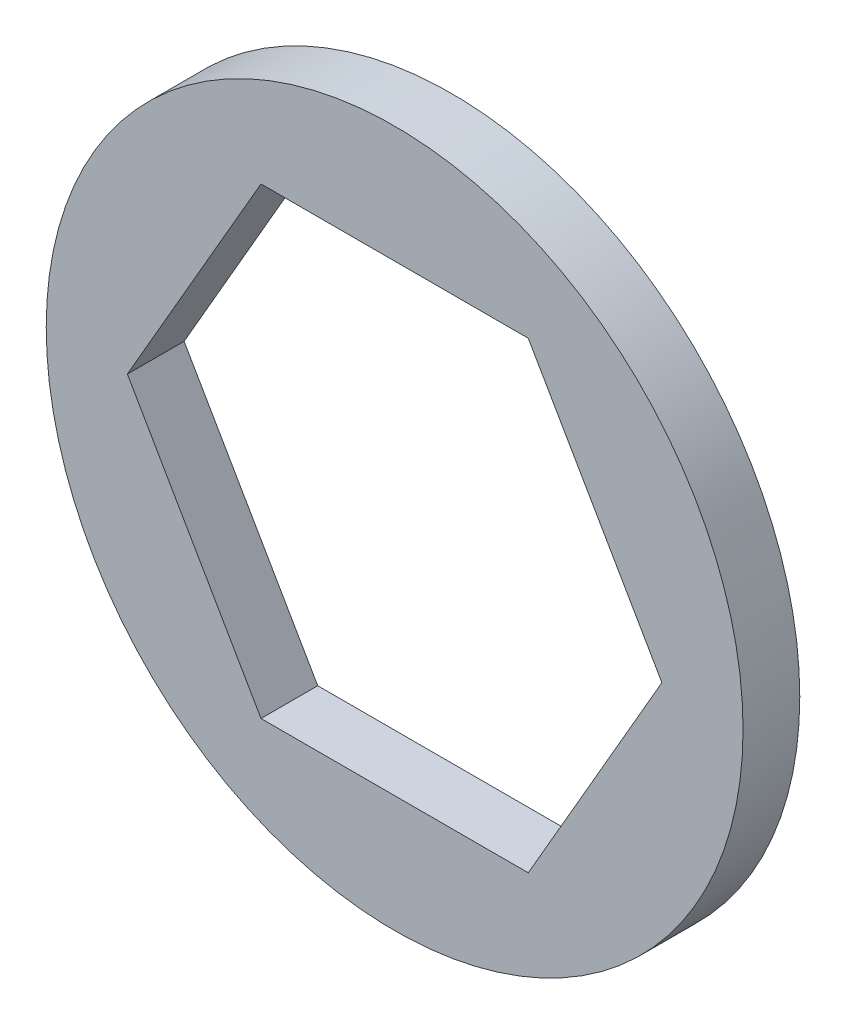
ISO-10303-21;
HEADER;
FILE_DESCRIPTION(('STEP AP214'),'2;1');
FILE_NAME('part.step','',(''),(''),'','','');
FILE_SCHEMA(('AUTOMOTIVE_DESIGN { 1 0 10303 214 1 1 1 1 }'));
ENDSEC;
DATA;
#1=APPLICATION_CONTEXT('core data for automotive mechanical design processes');
#2=APPLICATION_PROTOCOL_DEFINITION('international standard','automotive_design',2000,#1);
#3=PRODUCT_CONTEXT('',#1,'mechanical');
#4=PRODUCT('Part','Part','',(#3));
#5=PRODUCT_RELATED_PRODUCT_CATEGORY('part','',(#4));
#6=PRODUCT_DEFINITION_FORMATION('','',#4);
#7=PRODUCT_DEFINITION_CONTEXT('part definition',#1,'design');
#8=PRODUCT_DEFINITION('design','',#6,#7);
#9=PRODUCT_DEFINITION_SHAPE('','',#8);
#10=(LENGTH_UNIT() NAMED_UNIT(*) SI_UNIT(.MILLI.,.METRE.));
#11=(NAMED_UNIT(*) PLANE_ANGLE_UNIT() SI_UNIT($,.RADIAN.));
#12=(NAMED_UNIT(*) SI_UNIT($,.STERADIAN.) SOLID_ANGLE_UNIT());
#13=UNCERTAINTY_MEASURE_WITH_UNIT(LENGTH_MEASURE(1.E-05),#10,'distance_accuracy_value','');
#14=(GEOMETRIC_REPRESENTATION_CONTEXT(3) GLOBAL_UNCERTAINTY_ASSIGNED_CONTEXT((#13)) GLOBAL_UNIT_ASSIGNED_CONTEXT((#10,
#11,#12)) REPRESENTATION_CONTEXT('',''));
#15=CARTESIAN_POINT('',(0.,0.,0.));
#16=DIRECTION('',(0.,0.,1.));
#17=DIRECTION('',(1.,0.,0.));
#18=AXIS2_PLACEMENT_3D('',#15,#16,#17);
#19=CARTESIAN_POINT('',(0.,0.,0.79375));
#20=DIRECTION('',(0.,0.,1.));
#21=DIRECTION('',(1.,0.,0.));
#22=AXIS2_PLACEMENT_3D('',#19,#20,#21);
#23=PLANE('',#22);
#24=DIRECTION('',(1.,0.,0.));
#25=VECTOR('',#24,1.);
#26=CARTESIAN_POINT('',(3.7394976935412,6.477,0.79375));
#27=LINE('',#26,#25);
#28=CARTESIAN_POINT('',(3.7394976935412,6.477,0.79375));
#29=VERTEX_POINT('',#28);
#30=CARTESIAN_POINT('',(-3.73949769354121,6.477,0.79375));
#31=VERTEX_POINT('',#30);
#32=EDGE_CURVE('E74',#29,#31,#27,.F.);
#33=ORIENTED_EDGE('',*,*,#32,.F.);
#34=DIRECTION('',(0.5,-0.866025403784439,0.));
#35=VECTOR('',#34,1.);
#36=CARTESIAN_POINT('',(7.47899538708241,0.,0.79375));
#37=LINE('',#36,#35);
#38=CARTESIAN_POINT('',(7.47899538708242,0.,0.79375));
#39=VERTEX_POINT('',#38);
#40=EDGE_CURVE('E122',#39,#29,#37,.F.);
#41=ORIENTED_EDGE('',*,*,#40,.F.);
#42=DIRECTION('',(-0.5,-0.866025403784439,0.));
#43=VECTOR('',#42,1.);
#44=CARTESIAN_POINT('',(3.73949769354121,-6.477,0.79375));
#45=LINE('',#44,#43);
#46=CARTESIAN_POINT('',(3.73949769354121,-6.477,0.79375));
#47=VERTEX_POINT('',#46);
#48=EDGE_CURVE('E118',#47,#39,#45,.F.);
#49=ORIENTED_EDGE('',*,*,#48,.F.);
#50=DIRECTION('',(1.,0.,0.));
#51=VECTOR('',#50,1.);
#52=CARTESIAN_POINT('',(-3.73949769354121,-6.477,0.79375));
#53=LINE('',#52,#51);
#54=CARTESIAN_POINT('',(-3.73949769354121,-6.477,0.79375));
#55=VERTEX_POINT('',#54);
#56=EDGE_CURVE('E93',#55,#47,#53,.T.);
#57=ORIENTED_EDGE('',*,*,#56,.F.);
#58=DIRECTION('',(-0.5,0.866025403784439,0.));
#59=VECTOR('',#58,1.);
#60=CARTESIAN_POINT('',(-7.47899538708241,0.,0.79375));
#61=LINE('',#60,#59);
#62=CARTESIAN_POINT('',(-7.47899538708241,0.,0.79375));
#63=VERTEX_POINT('',#62);
#64=EDGE_CURVE('E88',#63,#55,#61,.F.);
#65=ORIENTED_EDGE('',*,*,#64,.F.);
#66=DIRECTION('',(0.5,0.866025403784439,0.));
#67=VECTOR('',#66,1.);
#68=CARTESIAN_POINT('',(-3.73949769354121,6.477,0.79375));
#69=LINE('',#68,#67);
#70=EDGE_CURVE('E79',#31,#63,#69,.F.);
#71=ORIENTED_EDGE('',*,*,#70,.F.);
#72=EDGE_LOOP('',(#33,#41,#49,#57,#65,#71));
#73=FACE_BOUND('',#72,.T.);
#74=CARTESIAN_POINT('',(0.,0.,0.79375));
#75=DIRECTION('',(0.,0.,-1.));
#76=DIRECTION('',(-1.,0.,0.));
#77=AXIS2_PLACEMENT_3D('',#74,#75,#76);
#78=CIRCLE('',#77,9.75);
#79=CARTESIAN_POINT('',(-9.75,0.,0.79375));
#80=VERTEX_POINT('',#79);
#81=EDGE_CURVE('E28',#80,#80,#78,.T.);
#82=ORIENTED_EDGE('',*,*,#81,.F.);
#83=EDGE_LOOP('',(#82));
#84=FACE_BOUND('',#83,.T.);
#85=ADVANCED_FACE('F25',(#73,#84),#23,.T.);
#86=CARTESIAN_POINT('',(0.,0.,0.79375));
#87=DIRECTION('',(0.,0.,-1.));
#88=DIRECTION('',(-1.,0.,0.));
#89=AXIS2_PLACEMENT_3D('',#86,#87,#88);
#90=CYLINDRICAL_SURFACE('',#89,9.75);
#91=ORIENTED_EDGE('',*,*,#81,.T.);
#92=EDGE_LOOP('',(#91));
#93=FACE_BOUND('',#92,.T.);
#94=CARTESIAN_POINT('',(0.,0.,-0.79375));
#95=DIRECTION('',(0.,0.,-1.));
#96=DIRECTION('',(-1.,0.,0.));
#97=AXIS2_PLACEMENT_3D('',#94,#95,#96);
#98=CIRCLE('',#97,9.75);
#99=CARTESIAN_POINT('',(-9.75,0.,-0.79375));
#100=VERTEX_POINT('',#99);
#101=EDGE_CURVE('E104',#100,#100,#98,.F.);
#102=ORIENTED_EDGE('',*,*,#101,.T.);
#103=EDGE_LOOP('',(#102));
#104=FACE_BOUND('',#103,.T.);
#105=ADVANCED_FACE('F198',(#93,#104),#90,.T.);
#106=CARTESIAN_POINT('',(-7.47899538708241,0.,0.79375));
#107=DIRECTION('',(0.866025403784439,0.5,0.));
#108=DIRECTION('',(-0.5,0.866025403784439,0.));
#109=AXIS2_PLACEMENT_3D('',#106,#107,#108);
#110=PLANE('',#109);
#111=ORIENTED_EDGE('',*,*,#64,.T.);
#112=DIRECTION('',(0.,0.,1.));
#113=VECTOR('',#112,1.);
#114=CARTESIAN_POINT('',(-3.73949769354121,-6.477,0.79375));
#115=LINE('',#114,#113);
#116=CARTESIAN_POINT('',(-3.73949769354121,-6.477,-0.79375));
#117=VERTEX_POINT('',#116);
#118=EDGE_CURVE('E111',#117,#55,#115,.T.);
#119=ORIENTED_EDGE('',*,*,#118,.F.);
#120=DIRECTION('',(-0.5,0.866025403784439,0.));
#121=VECTOR('',#120,1.);
#122=CARTESIAN_POINT('',(-3.73949769354121,-6.477,-0.79375));
#123=LINE('',#122,#121);
#124=CARTESIAN_POINT('',(-7.47899538708241,0.,-0.79375));
#125=VERTEX_POINT('',#124);
#126=EDGE_CURVE('E100',#117,#125,#123,.T.);
#127=ORIENTED_EDGE('',*,*,#126,.T.);
#128=DIRECTION('',(0.,0.,1.));
#129=VECTOR('',#128,1.);
#130=CARTESIAN_POINT('',(-7.47899538708241,0.,0.79375));
#131=LINE('',#130,#129);
#132=EDGE_CURVE('E84',#63,#125,#131,.F.);
#133=ORIENTED_EDGE('',*,*,#132,.F.);
#134=EDGE_LOOP('',(#111,#119,#127,#133));
#135=FACE_BOUND('',#134,.T.);
#136=ADVANCED_FACE('F99',(#135),#110,.T.);
#137=CARTESIAN_POINT('',(-3.73949769354121,6.477,0.79375));
#138=DIRECTION('',(0.866025403784439,-0.5,0.));
#139=DIRECTION('',(0.5,0.866025403784439,0.));
#140=AXIS2_PLACEMENT_3D('',#137,#138,#139);
#141=PLANE('',#140);
#142=ORIENTED_EDGE('',*,*,#70,.T.);
#143=ORIENTED_EDGE('',*,*,#132,.T.);
#144=DIRECTION('',(0.5,0.866025403784439,0.));
#145=VECTOR('',#144,1.);
#146=CARTESIAN_POINT('',(-7.47899538708241,0.,-0.79375));
#147=LINE('',#146,#145);
#148=CARTESIAN_POINT('',(-3.73949769354121,6.477,-0.79375));
#149=VERTEX_POINT('',#148);
#150=EDGE_CURVE('E108',#125,#149,#147,.T.);
#151=ORIENTED_EDGE('',*,*,#150,.T.);
#152=DIRECTION('',(0.,0.,1.));
#153=VECTOR('',#152,1.);
#154=CARTESIAN_POINT('',(-3.73949769354121,6.477,0.79375));
#155=LINE('',#154,#153);
#156=EDGE_CURVE('E86',#31,#149,#155,.F.);
#157=ORIENTED_EDGE('',*,*,#156,.F.);
#158=EDGE_LOOP('',(#142,#143,#151,#157));
#159=FACE_BOUND('',#158,.T.);
#160=ADVANCED_FACE('F81',(#159),#141,.T.);
#161=CARTESIAN_POINT('',(3.7394976935412,6.477,0.79375));
#162=DIRECTION('',(0.,-1.,0.));
#163=DIRECTION('',(1.,0.,0.));
#164=AXIS2_PLACEMENT_3D('',#161,#162,#163);
#165=PLANE('',#164);
#166=ORIENTED_EDGE('',*,*,#32,.T.);
#167=ORIENTED_EDGE('',*,*,#156,.T.);
#168=DIRECTION('',(1.,0.,0.));
#169=VECTOR('',#168,1.);
#170=CARTESIAN_POINT('',(0.,6.477,-0.79375));
#171=LINE('',#170,#169);
#172=CARTESIAN_POINT('',(3.7394976935412,6.477,-0.79375));
#173=VERTEX_POINT('',#172);
#174=EDGE_CURVE('E126',#149,#173,#171,.T.);
#175=ORIENTED_EDGE('',*,*,#174,.T.);
#176=DIRECTION('',(0.,0.,1.));
#177=VECTOR('',#176,1.);
#178=CARTESIAN_POINT('',(3.7394976935412,6.47700000000001,0.79375));
#179=LINE('',#178,#177);
#180=EDGE_CURVE('E120',#29,#173,#179,.F.);
#181=ORIENTED_EDGE('',*,*,#180,.F.);
#182=EDGE_LOOP('',(#166,#167,#175,#181));
#183=FACE_BOUND('',#182,.T.);
#184=ADVANCED_FACE('F125',(#183),#165,.T.);
#185=CARTESIAN_POINT('',(7.47899538708241,0.,0.79375));
#186=DIRECTION('',(-0.866025403784439,-0.5,0.));
#187=DIRECTION('',(0.5,-0.866025403784439,0.));
#188=AXIS2_PLACEMENT_3D('',#185,#186,#187);
#189=PLANE('',#188);
#190=ORIENTED_EDGE('',*,*,#40,.T.);
#191=ORIENTED_EDGE('',*,*,#180,.T.);
#192=DIRECTION('',(0.5,-0.866025403784438,0.));
#193=VECTOR('',#192,1.);
#194=CARTESIAN_POINT('',(3.7394976935412,6.477,-0.79375));
#195=LINE('',#194,#193);
#196=CARTESIAN_POINT('',(7.47899538708241,0.,-0.79375));
#197=VERTEX_POINT('',#196);
#198=EDGE_CURVE('E133',#173,#197,#195,.T.);
#199=ORIENTED_EDGE('',*,*,#198,.T.);
#200=DIRECTION('',(0.,0.,1.));
#201=VECTOR('',#200,1.);
#202=CARTESIAN_POINT('',(7.47899538708242,0.,0.79375));
#203=LINE('',#202,#201);
#204=EDGE_CURVE('E116',#39,#197,#203,.F.);
#205=ORIENTED_EDGE('',*,*,#204,.F.);
#206=EDGE_LOOP('',(#190,#191,#199,#205));
#207=FACE_BOUND('',#206,.T.);
#208=ADVANCED_FACE('F142',(#207),#189,.T.);
#209=CARTESIAN_POINT('',(3.73949769354121,-6.477,0.79375));
#210=DIRECTION('',(-0.866025403784439,0.5,0.));
#211=DIRECTION('',(-0.5,-0.866025403784439,0.));
#212=AXIS2_PLACEMENT_3D('',#209,#210,#211);
#213=PLANE('',#212);
#214=ORIENTED_EDGE('',*,*,#48,.T.);
#215=ORIENTED_EDGE('',*,*,#204,.T.);
#216=DIRECTION('',(-0.5,-0.866025403784439,0.));
#217=VECTOR('',#216,1.);
#218=CARTESIAN_POINT('',(7.47899538708241,0.,-0.79375));
#219=LINE('',#218,#217);
#220=CARTESIAN_POINT('',(3.73949769354121,-6.477,-0.79375));
#221=VERTEX_POINT('',#220);
#222=EDGE_CURVE('E34',#197,#221,#219,.T.);
#223=ORIENTED_EDGE('',*,*,#222,.T.);
#224=DIRECTION('',(0.,0.,1.));
#225=VECTOR('',#224,1.);
#226=CARTESIAN_POINT('',(3.73949769354121,-6.477,0.79375));
#227=LINE('',#226,#225);
#228=EDGE_CURVE('E42',#47,#221,#227,.F.);
#229=ORIENTED_EDGE('',*,*,#228,.F.);
#230=EDGE_LOOP('',(#214,#215,#223,#229));
#231=FACE_BOUND('',#230,.T.);
#232=ADVANCED_FACE('F139',(#231),#213,.T.);
#233=CARTESIAN_POINT('',(-3.73949769354121,-6.477,0.79375));
#234=DIRECTION('',(0.,1.,0.));
#235=DIRECTION('',(0.,0.,1.));
#236=AXIS2_PLACEMENT_3D('',#233,#234,#235);
#237=PLANE('',#236);
#238=ORIENTED_EDGE('',*,*,#56,.T.);
#239=ORIENTED_EDGE('',*,*,#228,.T.);
#240=DIRECTION('',(1.,0.,0.));
#241=VECTOR('',#240,1.);
#242=CARTESIAN_POINT('',(0.,-6.477,-0.79375));
#243=LINE('',#242,#241);
#244=EDGE_CURVE('E13',#221,#117,#243,.F.);
#245=ORIENTED_EDGE('',*,*,#244,.T.);
#246=ORIENTED_EDGE('',*,*,#118,.T.);
#247=EDGE_LOOP('',(#238,#239,#245,#246));
#248=FACE_BOUND('',#247,.T.);
#249=ADVANCED_FACE('F151',(#248),#237,.T.);
#250=CARTESIAN_POINT('',(0.,0.,-0.79375));
#251=DIRECTION('',(0.,0.,1.));
#252=DIRECTION('',(1.,0.,0.));
#253=AXIS2_PLACEMENT_3D('',#250,#251,#252);
#254=PLANE('',#253);
#255=ORIENTED_EDGE('',*,*,#222,.F.);
#256=ORIENTED_EDGE('',*,*,#198,.F.);
#257=ORIENTED_EDGE('',*,*,#174,.F.);
#258=ORIENTED_EDGE('',*,*,#150,.F.);
#259=ORIENTED_EDGE('',*,*,#126,.F.);
#260=ORIENTED_EDGE('',*,*,#244,.F.);
#261=EDGE_LOOP('',(#255,#256,#257,#258,#259,#260));
#262=FACE_BOUND('',#261,.T.);
#263=ORIENTED_EDGE('',*,*,#101,.F.);
#264=EDGE_LOOP('',(#263));
#265=FACE_BOUND('',#264,.T.);
#266=ADVANCED_FACE('F130',(#262,#265),#254,.F.);
#267=CLOSED_SHELL('',(#85,#105,#136,#160,#184,#208,#232,#249,#266));
#268=MANIFOLD_SOLID_BREP('B1',#267);
#269=ADVANCED_BREP_SHAPE_REPRESENTATION('',(#18,#268),#14);
#270=SHAPE_DEFINITION_REPRESENTATION(#9,#269);
ENDSEC;
END-ISO-10303-21;
